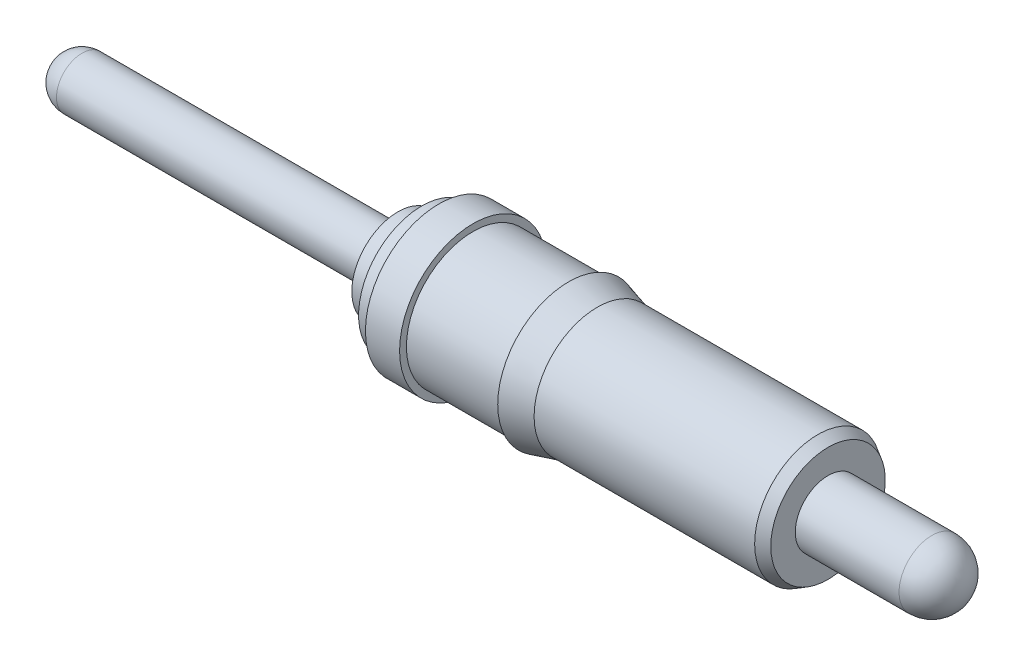
ISO-10303-21;
HEADER;
FILE_DESCRIPTION(('STEP AP214'),'2;1');
FILE_NAME('part.step','',(''),(''),'','','');
FILE_SCHEMA(('AUTOMOTIVE_DESIGN { 1 0 10303 214 1 1 1 1 }'));
ENDSEC;
DATA;
#1=APPLICATION_CONTEXT('core data for automotive mechanical design processes');
#2=APPLICATION_PROTOCOL_DEFINITION('international standard','automotive_design',2000,#1);
#3=PRODUCT_CONTEXT('',#1,'mechanical');
#4=PRODUCT('Part','Part','',(#3));
#5=PRODUCT_RELATED_PRODUCT_CATEGORY('part','',(#4));
#6=PRODUCT_DEFINITION_FORMATION('','',#4);
#7=PRODUCT_DEFINITION_CONTEXT('part definition',#1,'design');
#8=PRODUCT_DEFINITION('design','',#6,#7);
#9=PRODUCT_DEFINITION_SHAPE('','',#8);
#10=(LENGTH_UNIT() NAMED_UNIT(*) SI_UNIT(.MILLI.,.METRE.));
#11=(NAMED_UNIT(*) PLANE_ANGLE_UNIT() SI_UNIT($,.RADIAN.));
#12=(NAMED_UNIT(*) SI_UNIT($,.STERADIAN.) SOLID_ANGLE_UNIT());
#13=UNCERTAINTY_MEASURE_WITH_UNIT(LENGTH_MEASURE(1.E-05),#10,'distance_accuracy_value','');
#14=(GEOMETRIC_REPRESENTATION_CONTEXT(3) GLOBAL_UNCERTAINTY_ASSIGNED_CONTEXT((#13)) GLOBAL_UNIT_ASSIGNED_CONTEXT((#10,
#11,#12)) REPRESENTATION_CONTEXT('',''));
#15=CARTESIAN_POINT('',(0.,0.,0.));
#16=DIRECTION('',(0.,0.,1.));
#17=DIRECTION('',(1.,0.,0.));
#18=AXIS2_PLACEMENT_3D('',#15,#16,#17);
#19=CARTESIAN_POINT('',(0.,0.,0.));
#20=DIRECTION('',(1.,0.,0.));
#21=DIRECTION('',(0.,0.,-1.));
#22=AXIS2_PLACEMENT_3D('',#19,#20,#21);
#23=PLANE('',#22);
#24=CARTESIAN_POINT('',(0.,0.,0.));
#25=DIRECTION('',(1.,0.,0.));
#26=DIRECTION('',(0.,0.,-1.));
#27=AXIS2_PLACEMENT_3D('',#24,#25,#26);
#28=CIRCLE('',#27,0.4699);
#29=CARTESIAN_POINT('',(0.,0.,-0.4699));
#30=VERTEX_POINT('',#29);
#31=EDGE_CURVE('E31',#30,#30,#28,.F.);
#32=ORIENTED_EDGE('',*,*,#31,.F.);
#33=EDGE_LOOP('',(#32));
#34=FACE_BOUND('',#33,.T.);
#35=CARTESIAN_POINT('',(0.,0.,0.));
#36=DIRECTION('',(-1.,0.,0.));
#37=DIRECTION('',(0.,0.,1.));
#38=AXIS2_PLACEMENT_3D('',#35,#36,#37);
#39=CIRCLE('',#38,0.5461);
#40=CARTESIAN_POINT('',(0.,0.,0.5461));
#41=VERTEX_POINT('',#40);
#42=EDGE_CURVE('E39',#41,#41,#39,.T.);
#43=ORIENTED_EDGE('',*,*,#42,.T.);
#44=EDGE_LOOP('',(#43));
#45=FACE_BOUND('',#44,.T.);
#46=ADVANCED_FACE('F14',(#34,#45),#23,.F.);
#47=CARTESIAN_POINT('',(0.,0.,0.));
#48=DIRECTION('',(-1.,0.,0.));
#49=DIRECTION('',(0.,0.,1.));
#50=AXIS2_PLACEMENT_3D('',#47,#48,#49);
#51=CYLINDRICAL_SURFACE('',#50,0.5461);
#52=ORIENTED_EDGE('',*,*,#42,.F.);
#53=EDGE_LOOP('',(#52));
#54=FACE_BOUND('',#53,.T.);
#55=CARTESIAN_POINT('',(0.254,0.,0.));
#56=DIRECTION('',(-1.,0.,0.));
#57=DIRECTION('',(0.,0.,1.));
#58=AXIS2_PLACEMENT_3D('',#55,#56,#57);
#59=CIRCLE('',#58,0.5461);
#60=CARTESIAN_POINT('',(0.254,0.,0.5461));
#61=VERTEX_POINT('',#60);
#62=EDGE_CURVE('E45',#61,#61,#59,.T.);
#63=ORIENTED_EDGE('',*,*,#62,.T.);
#64=EDGE_LOOP('',(#63));
#65=FACE_BOUND('',#64,.T.);
#66=ADVANCED_FACE('F119',(#54,#65),#51,.T.);
#67=CARTESIAN_POINT('',(0.254,0.4953,0.));
#68=DIRECTION('',(-1.,0.,0.));
#69=DIRECTION('',(0.,0.,1.));
#70=AXIS2_PLACEMENT_3D('',#67,#68,#69);
#71=PLANE('',#70);
#72=ORIENTED_EDGE('',*,*,#62,.F.);
#73=EDGE_LOOP('',(#72));
#74=FACE_BOUND('',#73,.T.);
#75=CARTESIAN_POINT('',(0.254,0.,0.));
#76=DIRECTION('',(-1.,0.,0.));
#77=DIRECTION('',(0.,0.,1.));
#78=AXIS2_PLACEMENT_3D('',#75,#76,#77);
#79=CIRCLE('',#78,0.4953);
#80=CARTESIAN_POINT('',(0.254,0.,0.4953));
#81=VERTEX_POINT('',#80);
#82=EDGE_CURVE('E49',#81,#81,#79,.T.);
#83=ORIENTED_EDGE('',*,*,#82,.T.);
#84=EDGE_LOOP('',(#83));
#85=FACE_BOUND('',#84,.T.);
#86=ADVANCED_FACE('F125',(#74,#85),#71,.F.);
#87=CARTESIAN_POINT('',(0.,0.,0.));
#88=DIRECTION('',(-1.,0.,0.));
#89=DIRECTION('',(0.,0.,1.));
#90=AXIS2_PLACEMENT_3D('',#87,#88,#89);
#91=CYLINDRICAL_SURFACE('',#90,0.4953);
#92=ORIENTED_EDGE('',*,*,#82,.F.);
#93=EDGE_LOOP('',(#92));
#94=FACE_BOUND('',#93,.T.);
#95=CARTESIAN_POINT('',(0.9652,0.,0.));
#96=DIRECTION('',(-1.,0.,0.));
#97=DIRECTION('',(0.,0.,1.));
#98=AXIS2_PLACEMENT_3D('',#95,#96,#97);
#99=CIRCLE('',#98,0.4953);
#100=CARTESIAN_POINT('',(0.9652,0.,0.4953));
#101=VERTEX_POINT('',#100);
#102=EDGE_CURVE('E53',#101,#101,#99,.T.);
#103=ORIENTED_EDGE('',*,*,#102,.T.);
#104=EDGE_LOOP('',(#103));
#105=FACE_BOUND('',#104,.T.);
#106=ADVANCED_FACE('F328',(#94,#105),#91,.T.);
#107=CARTESIAN_POINT('',(0.9652,0.4953,0.));
#108=DIRECTION('',(1.,0.,0.));
#109=DIRECTION('',(0.,0.,-1.));
#110=AXIS2_PLACEMENT_3D('',#107,#108,#109);
#111=PLANE('',#110);
#112=ORIENTED_EDGE('',*,*,#102,.F.);
#113=EDGE_LOOP('',(#112));
#114=FACE_BOUND('',#113,.T.);
#115=CARTESIAN_POINT('',(0.9652,0.,0.));
#116=DIRECTION('',(-1.,0.,0.));
#117=DIRECTION('',(0.,0.,1.));
#118=AXIS2_PLACEMENT_3D('',#115,#116,#117);
#119=CIRCLE('',#118,0.52705);
#120=CARTESIAN_POINT('',(0.9652,0.,0.52705));
#121=VERTEX_POINT('',#120);
#122=EDGE_CURVE('E57',#121,#121,#119,.T.);
#123=ORIENTED_EDGE('',*,*,#122,.T.);
#124=EDGE_LOOP('',(#123));
#125=FACE_BOUND('',#124,.T.);
#126=ADVANCED_FACE('F260',(#114,#125),#111,.F.);
#127=CARTESIAN_POINT('',(1.17848670365256,0.,0.));
#128=DIRECTION('',(-1.,0.,0.));
#129=DIRECTION('',(0.,0.,1.));
#130=AXIS2_PLACEMENT_3D('',#127,#128,#129);
#131=CONICAL_SURFACE('',#130,0.4699,0.26179938779915);
#132=ORIENTED_EDGE('',*,*,#122,.F.);
#133=EDGE_LOOP('',(#132));
#134=FACE_BOUND('',#133,.T.);
#135=CARTESIAN_POINT('',(1.17848670365256,0.,0.));
#136=DIRECTION('',(-1.,0.,0.));
#137=DIRECTION('',(0.,0.,1.));
#138=AXIS2_PLACEMENT_3D('',#135,#136,#137);
#139=CIRCLE('',#138,0.4699);
#140=CARTESIAN_POINT('',(1.17848670365256,0.,0.4699));
#141=VERTEX_POINT('',#140);
#142=EDGE_CURVE('E61',#141,#141,#139,.T.);
#143=ORIENTED_EDGE('',*,*,#142,.T.);
#144=EDGE_LOOP('',(#143));
#145=FACE_BOUND('',#144,.T.);
#146=ADVANCED_FACE('F245',(#134,#145),#131,.T.);
#147=CARTESIAN_POINT('',(0.,0.,0.));
#148=DIRECTION('',(-1.,0.,0.));
#149=DIRECTION('',(0.,0.,1.));
#150=AXIS2_PLACEMENT_3D('',#147,#148,#149);
#151=CYLINDRICAL_SURFACE('',#150,0.4699);
#152=ORIENTED_EDGE('',*,*,#142,.F.);
#153=EDGE_LOOP('',(#152));
#154=FACE_BOUND('',#153,.T.);
#155=CARTESIAN_POINT('',(2.8194,0.,0.));
#156=DIRECTION('',(-1.,0.,0.));
#157=DIRECTION('',(0.,0.,1.));
#158=AXIS2_PLACEMENT_3D('',#155,#156,#157);
#159=CIRCLE('',#158,0.4699);
#160=CARTESIAN_POINT('',(2.8194,0.,0.4699));
#161=VERTEX_POINT('',#160);
#162=EDGE_CURVE('E65',#161,#161,#159,.T.);
#163=ORIENTED_EDGE('',*,*,#162,.T.);
#164=EDGE_LOOP('',(#163));
#165=FACE_BOUND('',#164,.T.);
#166=ADVANCED_FACE('F228',(#154,#165),#151,.T.);
#167=CARTESIAN_POINT('',(2.8956,0.,0.));
#168=DIRECTION('',(-1.,0.,0.));
#169=DIRECTION('',(0.,0.,1.));
#170=AXIS2_PLACEMENT_3D('',#167,#168,#169);
#171=CONICAL_SURFACE('',#170,0.42590590948775,0.5235987755983);
#172=ORIENTED_EDGE('',*,*,#162,.F.);
#173=EDGE_LOOP('',(#172));
#174=FACE_BOUND('',#173,.T.);
#175=CARTESIAN_POINT('',(2.8956,0.,0.));
#176=DIRECTION('',(-1.,0.,0.));
#177=DIRECTION('',(0.,0.,1.));
#178=AXIS2_PLACEMENT_3D('',#175,#176,#177);
#179=CIRCLE('',#178,0.42590590948775);
#180=CARTESIAN_POINT('',(2.8956,0.,0.42590590948775));
#181=VERTEX_POINT('',#180);
#182=EDGE_CURVE('E69',#181,#181,#179,.T.);
#183=ORIENTED_EDGE('',*,*,#182,.T.);
#184=EDGE_LOOP('',(#183));
#185=FACE_BOUND('',#184,.T.);
#186=ADVANCED_FACE('F116',(#174,#185),#171,.T.);
#187=CARTESIAN_POINT('',(2.8956,0.42590590948775,0.));
#188=DIRECTION('',(-1.,0.,0.));
#189=DIRECTION('',(0.,0.,1.));
#190=AXIS2_PLACEMENT_3D('',#187,#188,#189);
#191=PLANE('',#190);
#192=CARTESIAN_POINT('',(2.8956,0.,0.));
#193=DIRECTION('',(-1.,0.,0.));
#194=DIRECTION('',(0.,0.,1.));
#195=AXIS2_PLACEMENT_3D('',#192,#193,#194);
#196=CIRCLE('',#195,0.24384);
#197=CARTESIAN_POINT('',(2.8956,0.,0.24384));
#198=VERTEX_POINT('',#197);
#199=EDGE_CURVE('E10',#198,#198,#196,.T.);
#200=ORIENTED_EDGE('',*,*,#199,.T.);
#201=EDGE_LOOP('',(#200));
#202=FACE_BOUND('',#201,.T.);
#203=ORIENTED_EDGE('',*,*,#182,.F.);
#204=EDGE_LOOP('',(#203));
#205=FACE_BOUND('',#204,.T.);
#206=ADVANCED_FACE('F106',(#202,#205),#191,.F.);
#207=CARTESIAN_POINT('',(-2.6543,0.,0.));
#208=DIRECTION('',(1.,0.,0.));
#209=DIRECTION('',(0.,0.933406039599299,-0.358821912986868));
#210=AXIS2_PLACEMENT_3D('',#207,#208,#209);
#211=SPHERICAL_SURFACE('',#210,0.1905);
#212=CARTESIAN_POINT('',(-2.6543,0.,0.));
#213=DIRECTION('',(1.,0.,0.));
#214=DIRECTION('',(0.,-0.358821912986868,-0.933406039599299));
#215=AXIS2_PLACEMENT_3D('',#212,#213,#214);
#216=CIRCLE('',#215,0.1905);
#217=CARTESIAN_POINT('',(-2.6543,-0.0683555744239988,-0.177813850543666));
#218=VERTEX_POINT('',#217);
#219=EDGE_CURVE('E92',#218,#218,#216,.T.);
#220=ORIENTED_EDGE('',*,*,#219,.F.);
#221=EDGE_LOOP('',(#220));
#222=FACE_BOUND('',#221,.T.);
#223=ADVANCED_FACE('F103',(#222),#211,.T.);
#224=CARTESIAN_POINT('',(0.970372608994821,0.,0.));
#225=DIRECTION('',(1.,0.,0.));
#226=DIRECTION('',(0.,-0.358821912986868,-0.933406039599299));
#227=AXIS2_PLACEMENT_3D('',#224,#225,#226);
#228=CYLINDRICAL_SURFACE('',#227,0.4699);
#229=ORIENTED_EDGE('',*,*,#31,.T.);
#230=EDGE_LOOP('',(#229));
#231=FACE_BOUND('',#230,.T.);
#232=CARTESIAN_POINT('',(-0.127,0.,0.));
#233=DIRECTION('',(1.,0.,0.));
#234=DIRECTION('',(0.,-0.358821912986868,-0.933406039599299));
#235=AXIS2_PLACEMENT_3D('',#232,#233,#234);
#236=CIRCLE('',#235,0.4699);
#237=CARTESIAN_POINT('',(-0.127,-0.16861041691253,-0.438607498007711));
#238=VERTEX_POINT('',#237);
#239=EDGE_CURVE('E72',#238,#238,#236,.T.);
#240=ORIENTED_EDGE('',*,*,#239,.T.);
#241=EDGE_LOOP('',(#240));
#242=FACE_BOUND('',#241,.T.);
#243=ADVANCED_FACE('F105',(#231,#242),#228,.T.);
#244=CARTESIAN_POINT('',(-0.127,0.438607498007711,-0.168610416912529));
#245=DIRECTION('',(1.,0.,0.));
#246=DIRECTION('',(0.,-0.358821912986868,-0.933406039599299));
#247=AXIS2_PLACEMENT_3D('',#244,#245,#246);
#248=PLANE('',#247);
#249=ORIENTED_EDGE('',*,*,#239,.F.);
#250=EDGE_LOOP('',(#249));
#251=FACE_BOUND('',#250,.T.);
#252=CARTESIAN_POINT('',(-0.127,0.,0.));
#253=DIRECTION('',(1.,0.,0.));
#254=DIRECTION('',(0.,-0.358821912986868,-0.933406039599299));
#255=AXIS2_PLACEMENT_3D('',#252,#253,#254);
#256=CIRCLE('',#255,0.3429);
#257=CARTESIAN_POINT('',(-0.127,-0.123040033963197,-0.320064930978599));
#258=VERTEX_POINT('',#257);
#259=EDGE_CURVE('E76',#258,#258,#256,.T.);
#260=ORIENTED_EDGE('',*,*,#259,.T.);
#261=EDGE_LOOP('',(#260));
#262=FACE_BOUND('',#261,.T.);
#263=ADVANCED_FACE('F113',(#251,#262),#248,.F.);
#264=CARTESIAN_POINT('',(0.970372608994821,0.,0.));
#265=DIRECTION('',(1.,0.,0.));
#266=DIRECTION('',(0.,-0.358821912986868,-0.933406039599299));
#267=AXIS2_PLACEMENT_3D('',#264,#265,#266);
#268=CYLINDRICAL_SURFACE('',#267,0.3429);
#269=ORIENTED_EDGE('',*,*,#259,.F.);
#270=EDGE_LOOP('',(#269));
#271=FACE_BOUND('',#270,.T.);
#272=CARTESIAN_POINT('',(-0.3048,0.,0.));
#273=DIRECTION('',(1.,0.,0.));
#274=DIRECTION('',(0.,-0.358821912986868,-0.933406039599299));
#275=AXIS2_PLACEMENT_3D('',#272,#273,#274);
#276=CIRCLE('',#275,0.3429);
#277=CARTESIAN_POINT('',(-0.3048,-0.123040033963197,-0.320064930978599));
#278=VERTEX_POINT('',#277);
#279=EDGE_CURVE('E80',#278,#278,#276,.T.);
#280=ORIENTED_EDGE('',*,*,#279,.T.);
#281=EDGE_LOOP('',(#280));
#282=FACE_BOUND('',#281,.T.);
#283=ADVANCED_FACE('F152',(#271,#282),#268,.T.);
#284=CARTESIAN_POINT('',(-0.3048,0.3200649309786,-0.123040033963197));
#285=DIRECTION('',(1.,0.,0.));
#286=DIRECTION('',(0.,-0.358821912986868,-0.933406039599299));
#287=AXIS2_PLACEMENT_3D('',#284,#285,#286);
#288=PLANE('',#287);
#289=ORIENTED_EDGE('',*,*,#279,.F.);
#290=EDGE_LOOP('',(#289));
#291=FACE_BOUND('',#290,.T.);
#292=CARTESIAN_POINT('',(-0.3048,0.,0.));
#293=DIRECTION('',(1.,0.,0.));
#294=DIRECTION('',(0.,-0.358821912986868,-0.933406039599299));
#295=AXIS2_PLACEMENT_3D('',#292,#293,#294);
#296=CIRCLE('',#295,0.2413);
#297=CARTESIAN_POINT('',(-0.3048,-0.0865837276037314,-0.225230877355311));
#298=VERTEX_POINT('',#297);
#299=EDGE_CURVE('E84',#298,#298,#296,.T.);
#300=ORIENTED_EDGE('',*,*,#299,.T.);
#301=EDGE_LOOP('',(#300));
#302=FACE_BOUND('',#301,.T.);
#303=ADVANCED_FACE('F145',(#291,#302),#288,.F.);
#304=CARTESIAN_POINT('',(-0.3556,0.,0.));
#305=DIRECTION('',(1.,0.,0.));
#306=DIRECTION('',(0.,-0.358821912986868,-0.933406039599299));
#307=AXIS2_PLACEMENT_3D('',#304,#305,#306);
#308=TOROIDAL_SURFACE('',#307,0.2413,0.0508);
#309=ORIENTED_EDGE('',*,*,#299,.F.);
#310=EDGE_LOOP('',(#309));
#311=FACE_BOUND('',#310,.T.);
#312=CARTESIAN_POINT('',(-0.3556,0.,0.));
#313=DIRECTION('',(1.,0.,0.));
#314=DIRECTION('',(0.,-0.358821912986868,-0.933406039599299));
#315=AXIS2_PLACEMENT_3D('',#312,#313,#314);
#316=CIRCLE('',#315,0.1905);
#317=CARTESIAN_POINT('',(-0.3556,-0.0683555744239985,-0.177813850543666));
#318=VERTEX_POINT('',#317);
#319=EDGE_CURVE('E88',#318,#318,#316,.T.);
#320=ORIENTED_EDGE('',*,*,#319,.T.);
#321=EDGE_LOOP('',(#320));
#322=FACE_BOUND('',#321,.T.);
#323=ADVANCED_FACE('F138',(#311,#322),#308,.F.);
#324=CARTESIAN_POINT('',(0.970372608994821,0.,0.));
#325=DIRECTION('',(1.,0.,0.));
#326=DIRECTION('',(0.,-0.358821912986868,-0.933406039599299));
#327=AXIS2_PLACEMENT_3D('',#324,#325,#326);
#328=CYLINDRICAL_SURFACE('',#327,0.1905);
#329=ORIENTED_EDGE('',*,*,#319,.F.);
#330=EDGE_LOOP('',(#329));
#331=FACE_BOUND('',#330,.T.);
#332=ORIENTED_EDGE('',*,*,#219,.T.);
#333=EDGE_LOOP('',(#332));
#334=FACE_BOUND('',#333,.T.);
#335=ADVANCED_FACE('F101',(#331,#334),#328,.T.);
#336=CARTESIAN_POINT('',(1.778,0.,0.));
#337=DIRECTION('',(-1.,0.,0.));
#338=DIRECTION('',(0.,-0.407206279530214,0.913336217343411));
#339=AXIS2_PLACEMENT_3D('',#336,#337,#338);
#340=CYLINDRICAL_SURFACE('',#339,0.24384);
#341=CARTESIAN_POINT('',(3.66776,0.,0.));
#342=DIRECTION('',(-1.,0.,0.));
#343=DIRECTION('',(0.,-0.407206279530214,0.913336217343411));
#344=AXIS2_PLACEMENT_3D('',#341,#342,#343);
#345=CIRCLE('',#344,0.24384);
#346=CARTESIAN_POINT('',(3.66776,-0.0992931792006474,0.222707903237017));
#347=VERTEX_POINT('',#346);
#348=EDGE_CURVE('E22',#347,#347,#345,.T.);
#349=ORIENTED_EDGE('',*,*,#348,.T.);
#350=EDGE_LOOP('',(#349));
#351=FACE_BOUND('',#350,.T.);
#352=ORIENTED_EDGE('',*,*,#199,.F.);
#353=EDGE_LOOP('',(#352));
#354=FACE_BOUND('',#353,.T.);
#355=ADVANCED_FACE('F131',(#351,#354),#340,.T.);
#356=CARTESIAN_POINT('',(3.66776,0.,0.));
#357=DIRECTION('',(-1.,0.,0.));
#358=DIRECTION('',(0.,0.913336217343411,0.407206279530214));
#359=AXIS2_PLACEMENT_3D('',#356,#357,#358);
#360=SPHERICAL_SURFACE('',#359,0.24384);
#361=ORIENTED_EDGE('',*,*,#348,.F.);
#362=EDGE_LOOP('',(#361));
#363=FACE_BOUND('',#362,.T.);
#364=ADVANCED_FACE('F16',(#363),#360,.T.);
#365=CLOSED_SHELL('',(#46,#66,#86,#106,#126,#146,#166,#186,#206,#223,#243,#263,#283,#303,#323,
#335,#355,#364));
#366=MANIFOLD_SOLID_BREP('B1',#365);
#367=ADVANCED_BREP_SHAPE_REPRESENTATION('',(#18,#366),#14);
#368=SHAPE_DEFINITION_REPRESENTATION(#9,#367);
ENDSEC;
END-ISO-10303-21;
